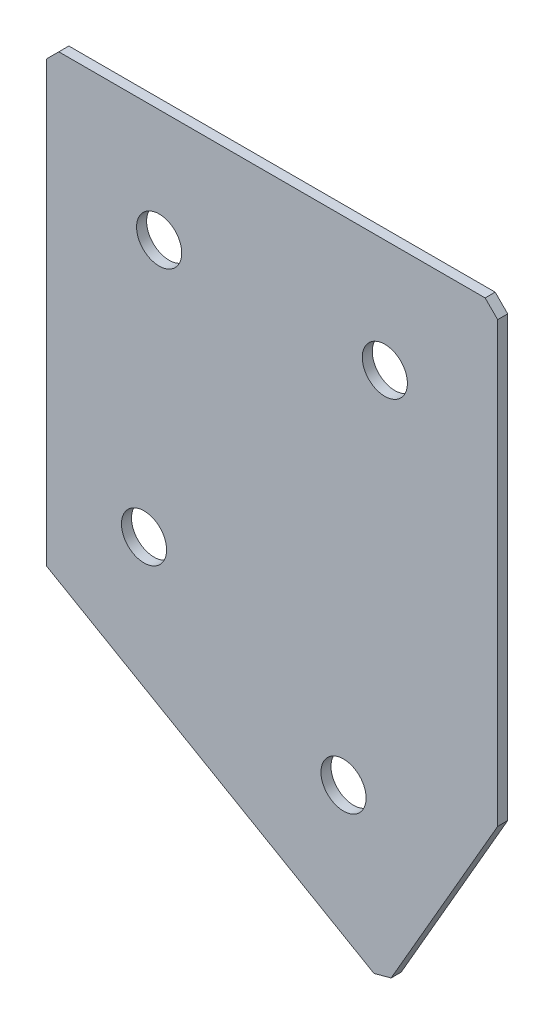
ISO-10303-21;
HEADER;
FILE_DESCRIPTION(('STEP AP214'),'2;1');
FILE_NAME('part.step','',(''),(''),'','','');
FILE_SCHEMA(('AUTOMOTIVE_DESIGN { 1 0 10303 214 1 1 1 1 }'));
ENDSEC;
DATA;
#1=APPLICATION_CONTEXT('core data for automotive mechanical design processes');
#2=APPLICATION_PROTOCOL_DEFINITION('international standard','automotive_design',2000,#1);
#3=PRODUCT_CONTEXT('',#1,'mechanical');
#4=PRODUCT('Part','Part','',(#3));
#5=PRODUCT_RELATED_PRODUCT_CATEGORY('part','',(#4));
#6=PRODUCT_DEFINITION_FORMATION('','',#4);
#7=PRODUCT_DEFINITION_CONTEXT('part definition',#1,'design');
#8=PRODUCT_DEFINITION('design','',#6,#7);
#9=PRODUCT_DEFINITION_SHAPE('','',#8);
#10=(LENGTH_UNIT() NAMED_UNIT(*) SI_UNIT(.MILLI.,.METRE.));
#11=(NAMED_UNIT(*) PLANE_ANGLE_UNIT() SI_UNIT($,.RADIAN.));
#12=(NAMED_UNIT(*) SI_UNIT($,.STERADIAN.) SOLID_ANGLE_UNIT());
#13=UNCERTAINTY_MEASURE_WITH_UNIT(LENGTH_MEASURE(1.E-05),#10,'distance_accuracy_value','');
#14=(GEOMETRIC_REPRESENTATION_CONTEXT(3) GLOBAL_UNCERTAINTY_ASSIGNED_CONTEXT((#13)) GLOBAL_UNIT_ASSIGNED_CONTEXT((#10,
#11,#12)) REPRESENTATION_CONTEXT('',''));
#15=CARTESIAN_POINT('',(0.,0.,0.));
#16=DIRECTION('',(0.,0.,1.));
#17=DIRECTION('',(1.,0.,0.));
#18=AXIS2_PLACEMENT_3D('',#15,#16,#17);
#19=CARTESIAN_POINT('',(0.,0.,-2.));
#20=DIRECTION('',(1.,0.,0.));
#21=DIRECTION('',(0.,0.,-1.));
#22=AXIS2_PLACEMENT_3D('',#19,#20,#21);
#23=PLANE('',#22);
#24=DIRECTION('',(0.,1.,0.));
#25=VECTOR('',#24,1.);
#26=CARTESIAN_POINT('',(0.,0.,0.));
#27=LINE('',#26,#25);
#28=CARTESIAN_POINT('',(0.,-90.,0.));
#29=VERTEX_POINT('',#28);
#30=CARTESIAN_POINT('',(0.,-2.5,0.));
#31=VERTEX_POINT('',#30);
#32=EDGE_CURVE('E137',#29,#31,#27,.T.);
#33=ORIENTED_EDGE('',*,*,#32,.T.);
#34=DIRECTION('',(0.,0.,-1.));
#35=VECTOR('',#34,1.);
#36=CARTESIAN_POINT('',(0.,-2.5,-2.));
#37=LINE('',#36,#35);
#38=CARTESIAN_POINT('',(0.,-2.5,-2.));
#39=VERTEX_POINT('',#38);
#40=EDGE_CURVE('E11',#31,#39,#37,.T.);
#41=ORIENTED_EDGE('',*,*,#40,.T.);
#42=DIRECTION('',(0.,1.,0.));
#43=VECTOR('',#42,1.);
#44=CARTESIAN_POINT('',(0.,0.,-2.));
#45=LINE('',#44,#43);
#46=CARTESIAN_POINT('',(0.,-90.,-2.));
#47=VERTEX_POINT('',#46);
#48=EDGE_CURVE('E153',#47,#39,#45,.T.);
#49=ORIENTED_EDGE('',*,*,#48,.F.);
#50=DIRECTION('',(0.,0.,1.));
#51=VECTOR('',#50,1.);
#52=CARTESIAN_POINT('',(0.,-90.,-2.));
#53=LINE('',#52,#51);
#54=EDGE_CURVE('E125',#47,#29,#53,.T.);
#55=ORIENTED_EDGE('',*,*,#54,.T.);
#56=EDGE_LOOP('',(#33,#41,#49,#55));
#57=FACE_BOUND('',#56,.T.);
#58=ADVANCED_FACE('F39',(#57),#23,.F.);
#59=CARTESIAN_POINT('',(0.,0.,-2.));
#60=DIRECTION('',(0.,-1.,0.));
#61=DIRECTION('',(0.,0.,-1.));
#62=AXIS2_PLACEMENT_3D('',#59,#60,#61);
#63=PLANE('',#62);
#64=DIRECTION('',(1.,0.,0.));
#65=VECTOR('',#64,1.);
#66=CARTESIAN_POINT('',(0.,0.,0.));
#67=LINE('',#66,#65);
#68=CARTESIAN_POINT('',(2.5,0.,0.));
#69=VERTEX_POINT('',#68);
#70=CARTESIAN_POINT('',(87.5,0.,0.));
#71=VERTEX_POINT('',#70);
#72=EDGE_CURVE('E141',#69,#71,#67,.T.);
#73=ORIENTED_EDGE('',*,*,#72,.T.);
#74=DIRECTION('',(0.,0.,-1.));
#75=VECTOR('',#74,1.);
#76=CARTESIAN_POINT('',(87.5,0.,-2.));
#77=LINE('',#76,#75);
#78=CARTESIAN_POINT('',(87.5,0.,-2.));
#79=VERTEX_POINT('',#78);
#80=EDGE_CURVE('E48',#71,#79,#77,.T.);
#81=ORIENTED_EDGE('',*,*,#80,.T.);
#82=DIRECTION('',(1.,0.,0.));
#83=VECTOR('',#82,1.);
#84=CARTESIAN_POINT('',(0.,0.,-2.));
#85=LINE('',#84,#83);
#86=CARTESIAN_POINT('',(2.5,0.,-2.));
#87=VERTEX_POINT('',#86);
#88=EDGE_CURVE('E113',#87,#79,#85,.T.);
#89=ORIENTED_EDGE('',*,*,#88,.F.);
#90=DIRECTION('',(0.,0.,1.));
#91=VECTOR('',#90,1.);
#92=CARTESIAN_POINT('',(2.5,0.,-2.));
#93=LINE('',#92,#91);
#94=EDGE_CURVE('E182',#87,#69,#93,.T.);
#95=ORIENTED_EDGE('',*,*,#94,.T.);
#96=EDGE_LOOP('',(#73,#81,#89,#95));
#97=FACE_BOUND('',#96,.T.);
#98=ADVANCED_FACE('F188',(#97),#63,.F.);
#99=CARTESIAN_POINT('',(90.,0.,-2.));
#100=DIRECTION('',(-1.,0.,0.));
#101=DIRECTION('',(0.,-1.,0.));
#102=AXIS2_PLACEMENT_3D('',#99,#100,#101);
#103=PLANE('',#102);
#104=DIRECTION('',(0.,-1.,0.));
#105=VECTOR('',#104,1.);
#106=CARTESIAN_POINT('',(90.,0.,-2.));
#107=LINE('',#106,#105);
#108=CARTESIAN_POINT('',(90.,-2.50000000000001,-2.));
#109=VERTEX_POINT('',#108);
#110=CARTESIAN_POINT('',(90.0000000000001,-90.0000000000002,-2.));
#111=VERTEX_POINT('',#110);
#112=EDGE_CURVE('E103',#109,#111,#107,.T.);
#113=ORIENTED_EDGE('',*,*,#112,.F.);
#114=DIRECTION('',(0.,0.,1.));
#115=VECTOR('',#114,1.);
#116=CARTESIAN_POINT('',(90.,-2.50000000000001,-2.));
#117=LINE('',#116,#115);
#118=CARTESIAN_POINT('',(90.,-2.50000000000001,0.));
#119=VERTEX_POINT('',#118);
#120=EDGE_CURVE('E179',#109,#119,#117,.T.);
#121=ORIENTED_EDGE('',*,*,#120,.T.);
#122=DIRECTION('',(0.,-1.,0.));
#123=VECTOR('',#122,1.);
#124=CARTESIAN_POINT('',(90.,0.,0.));
#125=LINE('',#124,#123);
#126=CARTESIAN_POINT('',(90.0000000000001,-90.0000000000002,0.));
#127=VERTEX_POINT('',#126);
#128=EDGE_CURVE('E119',#119,#127,#125,.T.);
#129=ORIENTED_EDGE('',*,*,#128,.T.);
#130=DIRECTION('',(0.,0.,1.));
#131=VECTOR('',#130,1.);
#132=CARTESIAN_POINT('',(90.0000000000001,-90.0000000000002,-2.));
#133=LINE('',#132,#131);
#134=EDGE_CURVE('E116',#111,#127,#133,.T.);
#135=ORIENTED_EDGE('',*,*,#134,.F.);
#136=EDGE_LOOP('',(#113,#121,#129,#135));
#137=FACE_BOUND('',#136,.T.);
#138=ADVANCED_FACE('F117',(#137),#103,.F.);
#139=CARTESIAN_POINT('',(67.5000000000001,-128.9711431703,-2.));
#140=DIRECTION('',(-0.866025403784438,0.500000000000001,0.));
#141=DIRECTION('',(-0.500000000000001,-0.866025403784438,0.));
#142=AXIS2_PLACEMENT_3D('',#139,#140,#141);
#143=PLANE('',#142);
#144=DIRECTION('',(-0.500000000000001,-0.866025403784438,0.));
#145=VECTOR('',#144,1.);
#146=CARTESIAN_POINT('',(67.5000000000001,-128.9711431703,0.));
#147=LINE('',#146,#145);
#148=CARTESIAN_POINT('',(68.7500000000001,-126.806079660839,0.));
#149=VERTEX_POINT('',#148);
#150=EDGE_CURVE('E147',#127,#149,#147,.T.);
#151=ORIENTED_EDGE('',*,*,#150,.T.);
#152=DIRECTION('',(0.,0.,-1.));
#153=VECTOR('',#152,1.);
#154=CARTESIAN_POINT('',(68.7500000000001,-126.806079660839,-2.));
#155=LINE('',#154,#153);
#156=CARTESIAN_POINT('',(68.7500000000001,-126.806079660839,-2.));
#157=VERTEX_POINT('',#156);
#158=EDGE_CURVE('E129',#149,#157,#155,.T.);
#159=ORIENTED_EDGE('',*,*,#158,.T.);
#160=DIRECTION('',(-0.500000000000001,-0.866025403784438,0.));
#161=VECTOR('',#160,1.);
#162=CARTESIAN_POINT('',(67.5000000000001,-128.9711431703,-2.));
#163=LINE('',#162,#161);
#164=EDGE_CURVE('E107',#111,#157,#163,.T.);
#165=ORIENTED_EDGE('',*,*,#164,.F.);
#166=ORIENTED_EDGE('',*,*,#134,.T.);
#167=EDGE_LOOP('',(#151,#159,#165,#166));
#168=FACE_BOUND('',#167,.T.);
#169=ADVANCED_FACE('F127',(#168),#143,.F.);
#170=CARTESIAN_POINT('',(0.,-90.,-2.));
#171=DIRECTION('',(0.500000000000001,0.866025403784438,0.));
#172=DIRECTION('',(-0.866025403784438,0.500000000000001,0.));
#173=AXIS2_PLACEMENT_3D('',#170,#171,#172);
#174=PLANE('',#173);
#175=DIRECTION('',(-0.866025403784438,0.500000000000001,0.));
#176=VECTOR('',#175,1.);
#177=CARTESIAN_POINT('',(0.,-90.,-2.));
#178=LINE('',#177,#176);
#179=CARTESIAN_POINT('',(65.3349364905389,-127.7211431703,-2.));
#180=VERTEX_POINT('',#179);
#181=EDGE_CURVE('E131',#180,#47,#178,.T.);
#182=ORIENTED_EDGE('',*,*,#181,.F.);
#183=DIRECTION('',(0.,0.,1.));
#184=VECTOR('',#183,1.);
#185=CARTESIAN_POINT('',(65.3349364905389,-127.7211431703,-2.));
#186=LINE('',#185,#184);
#187=CARTESIAN_POINT('',(65.3349364905389,-127.7211431703,0.));
#188=VERTEX_POINT('',#187);
#189=EDGE_CURVE('E124',#180,#188,#186,.T.);
#190=ORIENTED_EDGE('',*,*,#189,.T.);
#191=DIRECTION('',(-0.866025403784438,0.500000000000001,0.));
#192=VECTOR('',#191,1.);
#193=CARTESIAN_POINT('',(0.,-90.,0.));
#194=LINE('',#193,#192);
#195=EDGE_CURVE('E150',#188,#29,#194,.T.);
#196=ORIENTED_EDGE('',*,*,#195,.T.);
#197=ORIENTED_EDGE('',*,*,#54,.F.);
#198=EDGE_LOOP('',(#182,#190,#196,#197));
#199=FACE_BOUND('',#198,.T.);
#200=ADVANCED_FACE('F218',(#199),#174,.F.);
#201=CARTESIAN_POINT('',(0.,0.,-2.));
#202=DIRECTION('',(0.,0.,1.));
#203=DIRECTION('',(1.,0.,0.));
#204=AXIS2_PLACEMENT_3D('',#201,#202,#203);
#205=PLANE('',#204);
#206=CARTESIAN_POINT('',(22.5,-22.5,-2.));
#207=DIRECTION('',(0.,0.,-1.));
#208=DIRECTION('',(0.,1.,0.));
#209=AXIS2_PLACEMENT_3D('',#206,#207,#208);
#210=CIRCLE('',#209,4.5);
#211=CARTESIAN_POINT('',(22.5,-18.,-2.));
#212=VERTEX_POINT('',#211);
#213=EDGE_CURVE('E250',#212,#212,#210,.T.);
#214=ORIENTED_EDGE('',*,*,#213,.F.);
#215=EDGE_LOOP('',(#214));
#216=FACE_BOUND('',#215,.T.);
#217=CARTESIAN_POINT('',(67.5,-22.5,-2.));
#218=DIRECTION('',(0.,0.,-1.));
#219=DIRECTION('',(0.,1.,0.));
#220=AXIS2_PLACEMENT_3D('',#217,#218,#219);
#221=CIRCLE('',#220,4.5);
#222=CARTESIAN_POINT('',(67.5,-18.,-2.));
#223=VERTEX_POINT('',#222);
#224=EDGE_CURVE('E254',#223,#223,#221,.T.);
#225=ORIENTED_EDGE('',*,*,#224,.F.);
#226=EDGE_LOOP('',(#225));
#227=FACE_BOUND('',#226,.T.);
#228=CARTESIAN_POINT('',(19.4855715851499,-75.269237886467,-2.));
#229=DIRECTION('',(0.,0.,-1.));
#230=DIRECTION('',(0.,1.,0.));
#231=AXIS2_PLACEMENT_3D('',#228,#229,#230);
#232=CIRCLE('',#231,4.5);
#233=CARTESIAN_POINT('',(19.4855715851499,-70.769237886467,-2.));
#234=VERTEX_POINT('',#233);
#235=EDGE_CURVE('E264',#234,#234,#232,.T.);
#236=ORIENTED_EDGE('',*,*,#235,.F.);
#237=EDGE_LOOP('',(#236));
#238=FACE_BOUND('',#237,.T.);
#239=CARTESIAN_POINT('',(59.2644284148502,-98.2355715851501,-2.00000000000001));
#240=DIRECTION('',(0.,0.,-1.));
#241=DIRECTION('',(0.,1.,0.));
#242=AXIS2_PLACEMENT_3D('',#239,#240,#241);
#243=CIRCLE('',#242,4.5);
#244=CARTESIAN_POINT('',(59.2644284148502,-93.7355715851501,-2.00000000000001));
#245=VERTEX_POINT('',#244);
#246=EDGE_CURVE('E272',#245,#245,#243,.T.);
#247=ORIENTED_EDGE('',*,*,#246,.F.);
#248=EDGE_LOOP('',(#247));
#249=FACE_BOUND('',#248,.T.);
#250=ORIENTED_EDGE('',*,*,#164,.T.);
#251=DIRECTION('',(0.965925826289067,0.258819045102526,0.));
#252=VECTOR('',#251,1.);
#253=CARTESIAN_POINT('',(65.3349364905389,-127.7211431703,-2.));
#254=LINE('',#253,#252);
#255=EDGE_CURVE('E176',#157,#180,#254,.F.);
#256=ORIENTED_EDGE('',*,*,#255,.T.);
#257=ORIENTED_EDGE('',*,*,#181,.T.);
#258=ORIENTED_EDGE('',*,*,#48,.T.);
#259=DIRECTION('',(-0.707106781186548,-0.707106781186548,0.));
#260=VECTOR('',#259,1.);
#261=CARTESIAN_POINT('',(2.5,0.,-2.));
#262=LINE('',#261,#260);
#263=EDGE_CURVE('E171',#39,#87,#262,.F.);
#264=ORIENTED_EDGE('',*,*,#263,.T.);
#265=ORIENTED_EDGE('',*,*,#88,.T.);
#266=DIRECTION('',(-0.707106781186549,0.707106781186546,0.));
#267=VECTOR('',#266,1.);
#268=CARTESIAN_POINT('',(90.,-2.5,-2.));
#269=LINE('',#268,#267);
#270=EDGE_CURVE('E55',#79,#109,#269,.F.);
#271=ORIENTED_EDGE('',*,*,#270,.T.);
#272=ORIENTED_EDGE('',*,*,#112,.T.);
#273=EDGE_LOOP('',(#250,#256,#257,#258,#264,#265,#271,#272));
#274=FACE_BOUND('',#273,.T.);
#275=ADVANCED_FACE('F105',(#216,#227,#238,#249,#274),#205,.F.);
#276=CARTESIAN_POINT('',(0.,0.,0.));
#277=DIRECTION('',(0.,0.,1.));
#278=DIRECTION('',(1.,0.,0.));
#279=AXIS2_PLACEMENT_3D('',#276,#277,#278);
#280=PLANE('',#279);
#281=CARTESIAN_POINT('',(22.5,-22.5,0.));
#282=DIRECTION('',(0.,0.,-1.));
#283=DIRECTION('',(0.,1.,0.));
#284=AXIS2_PLACEMENT_3D('',#281,#282,#283);
#285=CIRCLE('',#284,4.5);
#286=CARTESIAN_POINT('',(22.5,-18.,0.));
#287=VERTEX_POINT('',#286);
#288=EDGE_CURVE('E247',#287,#287,#285,.T.);
#289=ORIENTED_EDGE('',*,*,#288,.T.);
#290=EDGE_LOOP('',(#289));
#291=FACE_BOUND('',#290,.T.);
#292=CARTESIAN_POINT('',(67.5,-22.5,0.));
#293=DIRECTION('',(0.,0.,-1.));
#294=DIRECTION('',(0.,1.,0.));
#295=AXIS2_PLACEMENT_3D('',#292,#293,#294);
#296=CIRCLE('',#295,4.5);
#297=CARTESIAN_POINT('',(67.5,-18.,0.));
#298=VERTEX_POINT('',#297);
#299=EDGE_CURVE('E260',#298,#298,#296,.T.);
#300=ORIENTED_EDGE('',*,*,#299,.T.);
#301=EDGE_LOOP('',(#300));
#302=FACE_BOUND('',#301,.T.);
#303=CARTESIAN_POINT('',(19.4855715851499,-75.269237886467,0.));
#304=DIRECTION('',(0.,0.,-1.));
#305=DIRECTION('',(0.,1.,0.));
#306=AXIS2_PLACEMENT_3D('',#303,#304,#305);
#307=CIRCLE('',#306,4.5);
#308=CARTESIAN_POINT('',(19.4855715851499,-70.769237886467,0.));
#309=VERTEX_POINT('',#308);
#310=EDGE_CURVE('E268',#309,#309,#307,.T.);
#311=ORIENTED_EDGE('',*,*,#310,.T.);
#312=EDGE_LOOP('',(#311));
#313=FACE_BOUND('',#312,.T.);
#314=CARTESIAN_POINT('',(59.2644284148502,-98.2355715851501,0.));
#315=DIRECTION('',(0.,0.,-1.));
#316=DIRECTION('',(0.,1.,0.));
#317=AXIS2_PLACEMENT_3D('',#314,#315,#316);
#318=CIRCLE('',#317,4.5);
#319=CARTESIAN_POINT('',(59.2644284148502,-93.7355715851501,0.));
#320=VERTEX_POINT('',#319);
#321=EDGE_CURVE('E142',#320,#320,#318,.T.);
#322=ORIENTED_EDGE('',*,*,#321,.T.);
#323=EDGE_LOOP('',(#322));
#324=FACE_BOUND('',#323,.T.);
#325=ORIENTED_EDGE('',*,*,#195,.F.);
#326=DIRECTION('',(-0.965925826289067,-0.258819045102526,0.));
#327=VECTOR('',#326,1.);
#328=CARTESIAN_POINT('',(36.3068966601204,-135.499183000719,0.));
#329=LINE('',#328,#327);
#330=EDGE_CURVE('E166',#188,#149,#329,.F.);
#331=ORIENTED_EDGE('',*,*,#330,.T.);
#332=ORIENTED_EDGE('',*,*,#150,.F.);
#333=ORIENTED_EDGE('',*,*,#128,.F.);
#334=DIRECTION('',(0.707106781186549,-0.707106781186546,0.));
#335=VECTOR('',#334,1.);
#336=CARTESIAN_POINT('',(43.7499999999998,43.75,0.));
#337=LINE('',#336,#335);
#338=EDGE_CURVE('E163',#119,#71,#337,.F.);
#339=ORIENTED_EDGE('',*,*,#338,.T.);
#340=ORIENTED_EDGE('',*,*,#72,.F.);
#341=DIRECTION('',(0.707106781186548,0.707106781186548,0.));
#342=VECTOR('',#341,1.);
#343=CARTESIAN_POINT('',(1.25,-1.25,0.));
#344=LINE('',#343,#342);
#345=EDGE_CURVE('E160',#69,#31,#344,.F.);
#346=ORIENTED_EDGE('',*,*,#345,.T.);
#347=ORIENTED_EDGE('',*,*,#32,.F.);
#348=EDGE_LOOP('',(#325,#331,#332,#333,#339,#340,#346,#347));
#349=FACE_BOUND('',#348,.T.);
#350=ADVANCED_FACE('F193',(#291,#302,#313,#324,#349),#280,.T.);
#351=CARTESIAN_POINT('',(59.2644284148502,-98.2355715851501,-2.00000000000001));
#352=DIRECTION('',(0.,0.,-1.));
#353=DIRECTION('',(0.,1.,0.));
#354=AXIS2_PLACEMENT_3D('',#351,#352,#353);
#355=CYLINDRICAL_SURFACE('',#354,4.5);
#356=ORIENTED_EDGE('',*,*,#321,.F.);
#357=EDGE_LOOP('',(#356));
#358=FACE_BOUND('',#357,.T.);
#359=ORIENTED_EDGE('',*,*,#246,.T.);
#360=EDGE_LOOP('',(#359));
#361=FACE_BOUND('',#360,.T.);
#362=ADVANCED_FACE('F224',(#358,#361),#355,.F.);
#363=CARTESIAN_POINT('',(19.4855715851499,-75.269237886467,-2.));
#364=DIRECTION('',(0.,0.,-1.));
#365=DIRECTION('',(0.,1.,0.));
#366=AXIS2_PLACEMENT_3D('',#363,#364,#365);
#367=CYLINDRICAL_SURFACE('',#366,4.5);
#368=ORIENTED_EDGE('',*,*,#310,.F.);
#369=EDGE_LOOP('',(#368));
#370=FACE_BOUND('',#369,.T.);
#371=ORIENTED_EDGE('',*,*,#235,.T.);
#372=EDGE_LOOP('',(#371));
#373=FACE_BOUND('',#372,.T.);
#374=ADVANCED_FACE('F231',(#370,#373),#367,.F.);
#375=CARTESIAN_POINT('',(67.5,-22.5,-2.));
#376=DIRECTION('',(0.,0.,-1.));
#377=DIRECTION('',(0.,1.,0.));
#378=AXIS2_PLACEMENT_3D('',#375,#376,#377);
#379=CYLINDRICAL_SURFACE('',#378,4.5);
#380=ORIENTED_EDGE('',*,*,#299,.F.);
#381=EDGE_LOOP('',(#380));
#382=FACE_BOUND('',#381,.T.);
#383=ORIENTED_EDGE('',*,*,#224,.T.);
#384=EDGE_LOOP('',(#383));
#385=FACE_BOUND('',#384,.T.);
#386=ADVANCED_FACE('F235',(#382,#385),#379,.F.);
#387=CARTESIAN_POINT('',(22.5,-22.5,-2.));
#388=DIRECTION('',(0.,0.,-1.));
#389=DIRECTION('',(0.,1.,0.));
#390=AXIS2_PLACEMENT_3D('',#387,#388,#389);
#391=CYLINDRICAL_SURFACE('',#390,4.5);
#392=ORIENTED_EDGE('',*,*,#288,.F.);
#393=EDGE_LOOP('',(#392));
#394=FACE_BOUND('',#393,.T.);
#395=ORIENTED_EDGE('',*,*,#213,.T.);
#396=EDGE_LOOP('',(#395));
#397=FACE_BOUND('',#396,.T.);
#398=ADVANCED_FACE('F203',(#394,#397),#391,.F.);
#399=CARTESIAN_POINT('',(65.3349364905389,-127.7211431703,-2.));
#400=DIRECTION('',(-0.258819045102526,0.965925826289067,0.));
#401=DIRECTION('',(0.,0.,1.));
#402=AXIS2_PLACEMENT_3D('',#399,#400,#401);
#403=PLANE('',#402);
#404=ORIENTED_EDGE('',*,*,#255,.F.);
#405=ORIENTED_EDGE('',*,*,#158,.F.);
#406=ORIENTED_EDGE('',*,*,#330,.F.);
#407=ORIENTED_EDGE('',*,*,#189,.F.);
#408=EDGE_LOOP('',(#404,#405,#406,#407));
#409=FACE_BOUND('',#408,.T.);
#410=ADVANCED_FACE('F198',(#409),#403,.F.);
#411=CARTESIAN_POINT('',(90.,-2.5,-2.));
#412=DIRECTION('',(-0.707106781186545,-0.707106781186549,0.));
#413=DIRECTION('',(0.,0.,1.));
#414=AXIS2_PLACEMENT_3D('',#411,#412,#413);
#415=PLANE('',#414);
#416=ORIENTED_EDGE('',*,*,#270,.F.);
#417=ORIENTED_EDGE('',*,*,#80,.F.);
#418=ORIENTED_EDGE('',*,*,#338,.F.);
#419=ORIENTED_EDGE('',*,*,#120,.F.);
#420=EDGE_LOOP('',(#416,#417,#418,#419));
#421=FACE_BOUND('',#420,.T.);
#422=ADVANCED_FACE('F196',(#421),#415,.F.);
#423=CARTESIAN_POINT('',(2.5,0.,-2.));
#424=DIRECTION('',(0.707106781186547,-0.707106781186547,0.));
#425=DIRECTION('',(0.,0.,1.));
#426=AXIS2_PLACEMENT_3D('',#423,#424,#425);
#427=PLANE('',#426);
#428=ORIENTED_EDGE('',*,*,#263,.F.);
#429=ORIENTED_EDGE('',*,*,#40,.F.);
#430=ORIENTED_EDGE('',*,*,#345,.F.);
#431=ORIENTED_EDGE('',*,*,#94,.F.);
#432=EDGE_LOOP('',(#428,#429,#430,#431));
#433=FACE_BOUND('',#432,.T.);
#434=ADVANCED_FACE('F41',(#433),#427,.F.);
#435=CLOSED_SHELL('',(#58,#98,#138,#169,#200,#275,#350,#362,#374,#386,#398,#410,#422,#434));
#436=MANIFOLD_SOLID_BREP('B2',#435);
#437=ADVANCED_BREP_SHAPE_REPRESENTATION('',(#18,#436),#14);
#438=SHAPE_DEFINITION_REPRESENTATION(#9,#437);
ENDSEC;
END-ISO-10303-21;
